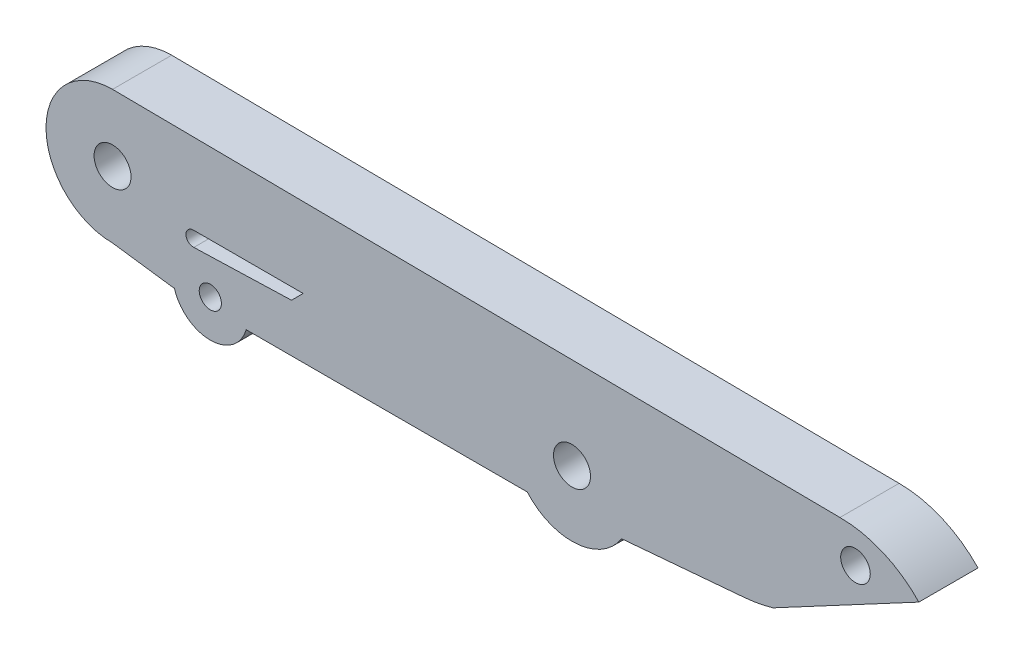
ISO-10303-21;
HEADER;
FILE_DESCRIPTION(('STEP AP214'),'2;1');
FILE_NAME('part.step','',(''),(''),'','','');
FILE_SCHEMA(('AUTOMOTIVE_DESIGN { 1 0 10303 214 1 1 1 1 }'));
ENDSEC;
DATA;
#1=APPLICATION_CONTEXT('core data for automotive mechanical design processes');
#2=APPLICATION_PROTOCOL_DEFINITION('international standard','automotive_design',2000,#1);
#3=PRODUCT_CONTEXT('',#1,'mechanical');
#4=PRODUCT('Part','Part','',(#3));
#5=PRODUCT_RELATED_PRODUCT_CATEGORY('part','',(#4));
#6=PRODUCT_DEFINITION_FORMATION('','',#4);
#7=PRODUCT_DEFINITION_CONTEXT('part definition',#1,'design');
#8=PRODUCT_DEFINITION('design','',#6,#7);
#9=PRODUCT_DEFINITION_SHAPE('','',#8);
#10=(LENGTH_UNIT() NAMED_UNIT(*) SI_UNIT(.MILLI.,.METRE.));
#11=(NAMED_UNIT(*) PLANE_ANGLE_UNIT() SI_UNIT($,.RADIAN.));
#12=(NAMED_UNIT(*) SI_UNIT($,.STERADIAN.) SOLID_ANGLE_UNIT());
#13=UNCERTAINTY_MEASURE_WITH_UNIT(LENGTH_MEASURE(1.E-05),#10,'distance_accuracy_value','');
#14=(GEOMETRIC_REPRESENTATION_CONTEXT(3) GLOBAL_UNCERTAINTY_ASSIGNED_CONTEXT((#13)) GLOBAL_UNIT_ASSIGNED_CONTEXT((#10,
#11,#12)) REPRESENTATION_CONTEXT('',''));
#15=CARTESIAN_POINT('',(0.,0.,0.));
#16=DIRECTION('',(0.,0.,1.));
#17=DIRECTION('',(1.,0.,0.));
#18=AXIS2_PLACEMENT_3D('',#15,#16,#17);
#19=CARTESIAN_POINT('',(9.71901764806382,-1.60643354689082,4.));
#20=DIRECTION('',(0.,0.,-1.));
#21=DIRECTION('',(-1.,0.,0.));
#22=AXIS2_PLACEMENT_3D('',#19,#20,#21);
#23=CYLINDRICAL_SURFACE('',#22,0.5);
#24=CARTESIAN_POINT('',(9.71901764806382,-1.60643354689082,0.));
#25=DIRECTION('',(0.,0.,1.));
#26=DIRECTION('',(1.,0.,0.));
#27=AXIS2_PLACEMENT_3D('',#24,#25,#26);
#28=CIRCLE('',#27,0.5);
#29=CARTESIAN_POINT('',(9.71901764806382,-1.10643354689082,0.));
#30=VERTEX_POINT('',#29);
#31=CARTESIAN_POINT('',(9.75050434930007,-2.10544114968386,0.));
#32=VERTEX_POINT('',#31);
#33=EDGE_CURVE('E226',#30,#32,#28,.T.);
#34=ORIENTED_EDGE('',*,*,#33,.F.);
#35=DIRECTION('',(0.,0.,-1.));
#36=VECTOR('',#35,1.);
#37=CARTESIAN_POINT('',(9.71901764806382,-1.10643354689082,4.));
#38=LINE('',#37,#36);
#39=CARTESIAN_POINT('',(9.71901764806382,-1.10643354689082,4.));
#40=VERTEX_POINT('',#39);
#41=EDGE_CURVE('E11',#40,#30,#38,.T.);
#42=ORIENTED_EDGE('',*,*,#41,.F.);
#43=CARTESIAN_POINT('',(9.71901764806382,-1.60643354689082,4.));
#44=DIRECTION('',(0.,0.,1.));
#45=DIRECTION('',(1.,0.,0.));
#46=AXIS2_PLACEMENT_3D('',#43,#44,#45);
#47=CIRCLE('',#46,0.5);
#48=CARTESIAN_POINT('',(9.75050434930007,-2.10544114968386,4.));
#49=VERTEX_POINT('',#48);
#50=EDGE_CURVE('E165',#40,#49,#47,.T.);
#51=ORIENTED_EDGE('',*,*,#50,.T.);
#52=DIRECTION('',(0.,0.,-1.));
#53=VECTOR('',#52,1.);
#54=CARTESIAN_POINT('',(9.75050434930007,-2.10544114968386,4.));
#55=LINE('',#54,#53);
#56=EDGE_CURVE('E109',#49,#32,#55,.T.);
#57=ORIENTED_EDGE('',*,*,#56,.T.);
#58=EDGE_LOOP('',(#34,#42,#51,#57));
#59=FACE_BOUND('',#58,.T.);
#60=ADVANCED_FACE('F35',(#59),#23,.F.);
#61=CARTESIAN_POINT('',(0.,-1.10643354689082,4.));
#62=DIRECTION('',(0.,1.,0.));
#63=DIRECTION('',(0.,0.,1.));
#64=AXIS2_PLACEMENT_3D('',#61,#62,#63);
#65=PLANE('',#64);
#66=DIRECTION('',(1.,0.,0.));
#67=VECTOR('',#66,1.);
#68=CARTESIAN_POINT('',(0.,-1.10643354689082,0.));
#69=LINE('',#68,#67);
#70=CARTESIAN_POINT('',(17.1467349564961,-1.10643354689082,0.));
#71=VERTEX_POINT('',#70);
#72=EDGE_CURVE('E170',#30,#71,#69,.T.);
#73=ORIENTED_EDGE('',*,*,#72,.T.);
#74=DIRECTION('',(0.,0.,-1.));
#75=VECTOR('',#74,1.);
#76=CARTESIAN_POINT('',(17.1467349564961,-1.10643354689082,4.));
#77=LINE('',#76,#75);
#78=CARTESIAN_POINT('',(17.1467349564961,-1.10643354689082,4.));
#79=VERTEX_POINT('',#78);
#80=EDGE_CURVE('E45',#79,#71,#77,.T.);
#81=ORIENTED_EDGE('',*,*,#80,.F.);
#82=DIRECTION('',(1.,0.,0.));
#83=VECTOR('',#82,1.);
#84=CARTESIAN_POINT('',(0.,-1.10643354689082,4.));
#85=LINE('',#84,#83);
#86=EDGE_CURVE('E160',#40,#79,#85,.T.);
#87=ORIENTED_EDGE('',*,*,#86,.F.);
#88=ORIENTED_EDGE('',*,*,#41,.T.);
#89=EDGE_LOOP('',(#73,#81,#87,#88));
#90=FACE_BOUND('',#89,.T.);
#91=ADVANCED_FACE('F168',(#90),#65,.F.);
#92=CARTESIAN_POINT('',(9.12658425169338,-9.12658425169347,4.));
#93=DIRECTION('',(0.707106781186544,-0.707106781186551,0.));
#94=DIRECTION('',(0.707106781186551,0.707106781186544,0.));
#95=AXIS2_PLACEMENT_3D('',#92,#93,#94);
#96=PLANE('',#95);
#97=DIRECTION('',(-0.707106781186551,-0.707106781186544,0.));
#98=VECTOR('',#97,1.);
#99=CARTESIAN_POINT('',(9.12658425169338,-9.12658425169347,0.));
#100=LINE('',#99,#98);
#101=CARTESIAN_POINT('',(16.3559166022838,-1.89725190110309,0.));
#102=VERTEX_POINT('',#101);
#103=EDGE_CURVE('E223',#71,#102,#100,.T.);
#104=ORIENTED_EDGE('',*,*,#103,.T.);
#105=DIRECTION('',(0.,0.,-1.));
#106=VECTOR('',#105,1.);
#107=CARTESIAN_POINT('',(16.3559166022838,-1.89725190110309,4.));
#108=LINE('',#107,#106);
#109=CARTESIAN_POINT('',(16.3559166022838,-1.89725190110309,4.));
#110=VERTEX_POINT('',#109);
#111=EDGE_CURVE('E159',#110,#102,#108,.T.);
#112=ORIENTED_EDGE('',*,*,#111,.F.);
#113=DIRECTION('',(-0.707106781186551,-0.707106781186544,0.));
#114=VECTOR('',#113,1.);
#115=CARTESIAN_POINT('',(9.12658425169338,-9.12658425169347,4.));
#116=LINE('',#115,#114);
#117=EDGE_CURVE('E153',#79,#110,#116,.T.);
#118=ORIENTED_EDGE('',*,*,#117,.F.);
#119=ORIENTED_EDGE('',*,*,#80,.T.);
#120=EDGE_LOOP('',(#104,#112,#118,#119));
#121=FACE_BOUND('',#120,.T.);
#122=ADVANCED_FACE('F156',(#121),#96,.F.);
#123=CARTESIAN_POINT('',(46.1270158500872,5.97056834285694,4.));
#124=DIRECTION('',(0.,0.,-1.));
#125=DIRECTION('',(-1.,0.,0.));
#126=AXIS2_PLACEMENT_3D('',#123,#124,#125);
#127=CYLINDRICAL_SURFACE('',#126,10.);
#128=CARTESIAN_POINT('',(46.1270158500872,5.97056834285694,0.));
#129=DIRECTION('',(0.,0.,1.));
#130=DIRECTION('',(1.,0.,0.));
#131=AXIS2_PLACEMENT_3D('',#128,#129,#130);
#132=CIRCLE('',#131,10.);
#133=CARTESIAN_POINT('',(48.9234589540693,-3.63046837023771,0.));
#134=VERTEX_POINT('',#133);
#135=CARTESIAN_POINT('',(46.980351468895,-3.99295604972995,0.));
#136=VERTEX_POINT('',#135);
#137=EDGE_CURVE('E250',#134,#136,#132,.F.);
#138=ORIENTED_EDGE('',*,*,#137,.F.);
#139=DIRECTION('',(0.,0.,-1.));
#140=VECTOR('',#139,1.);
#141=CARTESIAN_POINT('',(48.9234589540693,-3.63046837023771,4.));
#142=LINE('',#141,#140);
#143=CARTESIAN_POINT('',(48.9234589540693,-3.63046837023771,4.));
#144=VERTEX_POINT('',#143);
#145=EDGE_CURVE('E39',#144,#134,#142,.T.);
#146=ORIENTED_EDGE('',*,*,#145,.F.);
#147=CARTESIAN_POINT('',(46.1270158500872,5.97056834285694,4.));
#148=DIRECTION('',(0.,0.,1.));
#149=DIRECTION('',(1.,0.,0.));
#150=AXIS2_PLACEMENT_3D('',#147,#148,#149);
#151=CIRCLE('',#150,10.);
#152=CARTESIAN_POINT('',(46.980351468895,-3.99295604972995,4.));
#153=VERTEX_POINT('',#152);
#154=EDGE_CURVE('E212',#144,#153,#151,.F.);
#155=ORIENTED_EDGE('',*,*,#154,.T.);
#156=DIRECTION('',(0.,0.,-1.));
#157=VECTOR('',#156,1.);
#158=CARTESIAN_POINT('',(46.980351468895,-3.99295604972995,4.));
#159=LINE('',#158,#157);
#160=EDGE_CURVE('E175',#153,#136,#159,.T.);
#161=ORIENTED_EDGE('',*,*,#160,.T.);
#162=EDGE_LOOP('',(#138,#146,#155,#161));
#163=FACE_BOUND('',#162,.T.);
#164=ADVANCED_FACE('F37',(#163),#127,.T.);
#165=CARTESIAN_POINT('',(12.3698940911423,-23.1567149480587,4.));
#166=DIRECTION('',(-0.471170737125833,0.882042026479634,0.));
#167=DIRECTION('',(-0.882042026479634,-0.471170737125833,0.));
#168=AXIS2_PLACEMENT_3D('',#165,#166,#167);
#169=PLANE('',#168);
#170=DIRECTION('',(0.882042026479634,0.471170737125833,0.));
#171=VECTOR('',#170,1.);
#172=CARTESIAN_POINT('',(12.3698940911423,-23.1567149480587,0.));
#173=LINE('',#172,#171);
#174=CARTESIAN_POINT('',(58.7811323545646,1.63532067724634,0.));
#175=VERTEX_POINT('',#174);
#176=EDGE_CURVE('E248',#134,#175,#173,.T.);
#177=ORIENTED_EDGE('',*,*,#176,.T.);
#178=DIRECTION('',(0.,0.,-1.));
#179=VECTOR('',#178,1.);
#180=CARTESIAN_POINT('',(58.7811323545646,1.63532067724634,4.));
#181=LINE('',#180,#179);
#182=CARTESIAN_POINT('',(58.7811323545646,1.63532067724634,4.));
#183=VERTEX_POINT('',#182);
#184=EDGE_CURVE('E199',#183,#175,#181,.T.);
#185=ORIENTED_EDGE('',*,*,#184,.F.);
#186=DIRECTION('',(0.882042026479634,0.471170737125833,0.));
#187=VECTOR('',#186,1.);
#188=CARTESIAN_POINT('',(12.3698940911423,-23.1567149480587,4.));
#189=LINE('',#188,#187);
#190=EDGE_CURVE('E285',#144,#183,#189,.T.);
#191=ORIENTED_EDGE('',*,*,#190,.F.);
#192=ORIENTED_EDGE('',*,*,#145,.T.);
#193=EDGE_LOOP('',(#177,#185,#191,#192));
#194=FACE_BOUND('',#193,.T.);
#195=ADVANCED_FACE('F299',(#194),#169,.F.);
#196=CARTESIAN_POINT('',(53.445513312833,-3.43924105236474,4.));
#197=DIRECTION('',(0.,0.,-1.));
#198=DIRECTION('',(-1.,0.,0.));
#199=AXIS2_PLACEMENT_3D('',#196,#197,#198);
#200=CYLINDRICAL_SURFACE('',#199,7.36342361311113);
#201=CARTESIAN_POINT('',(53.445513312833,-3.43924105236474,0.));
#202=DIRECTION('',(0.,0.,1.));
#203=DIRECTION('',(1.,0.,0.));
#204=AXIS2_PLACEMENT_3D('',#201,#202,#203);
#205=CIRCLE('',#204,7.36342361311113);
#206=CARTESIAN_POINT('',(53.445513312833,3.92418256074639,0.));
#207=VERTEX_POINT('',#206);
#208=EDGE_CURVE('E246',#175,#207,#205,.T.);
#209=ORIENTED_EDGE('',*,*,#208,.T.);
#210=DIRECTION('',(0.,0.,-1.));
#211=VECTOR('',#210,1.);
#212=CARTESIAN_POINT('',(53.445513312833,3.92418256074639,4.));
#213=LINE('',#212,#211);
#214=CARTESIAN_POINT('',(53.445513312833,3.92418256074639,4.));
#215=VERTEX_POINT('',#214);
#216=EDGE_CURVE('E198',#215,#207,#213,.T.);
#217=ORIENTED_EDGE('',*,*,#216,.F.);
#218=CARTESIAN_POINT('',(53.445513312833,-3.43924105236474,4.));
#219=DIRECTION('',(0.,0.,1.));
#220=DIRECTION('',(1.,0.,0.));
#221=AXIS2_PLACEMENT_3D('',#218,#219,#220);
#222=CIRCLE('',#221,7.36342361311113);
#223=EDGE_CURVE('E283',#183,#215,#222,.T.);
#224=ORIENTED_EDGE('',*,*,#223,.F.);
#225=ORIENTED_EDGE('',*,*,#184,.T.);
#226=EDGE_LOOP('',(#209,#217,#224,#225));
#227=FACE_BOUND('',#226,.T.);
#228=ADVANCED_FACE('F301',(#227),#200,.T.);
#229=CARTESIAN_POINT('',(0.0432166339505001,4.44355651289284,4.));
#230=DIRECTION('',(0.00972522574244948,0.999952708873904,0.));
#231=DIRECTION('',(-0.999952708873904,0.00972522574244948,0.));
#232=AXIS2_PLACEMENT_3D('',#229,#230,#231);
#233=PLANE('',#232);
#234=DIRECTION('',(0.999952708873904,-0.00972522574244948,0.));
#235=VECTOR('',#234,1.);
#236=CARTESIAN_POINT('',(0.0432166339505001,4.44355651289284,0.));
#237=LINE('',#236,#235);
#238=CARTESIAN_POINT('',(4.25422013759811,4.40260161641445,0.));
#239=VERTEX_POINT('',#238);
#240=EDGE_CURVE('E243',#239,#207,#237,.T.);
#241=ORIENTED_EDGE('',*,*,#240,.F.);
#242=DIRECTION('',(0.,0.,-1.));
#243=VECTOR('',#242,1.);
#244=CARTESIAN_POINT('',(4.25422013759811,4.40260161641445,4.));
#245=LINE('',#244,#243);
#246=CARTESIAN_POINT('',(4.25422013759811,4.40260161641445,4.));
#247=VERTEX_POINT('',#246);
#248=EDGE_CURVE('E196',#247,#239,#245,.T.);
#249=ORIENTED_EDGE('',*,*,#248,.F.);
#250=DIRECTION('',(0.999952708873904,-0.00972522574244948,0.));
#251=VECTOR('',#250,1.);
#252=CARTESIAN_POINT('',(0.0432166339505001,4.44355651289284,4.));
#253=LINE('',#252,#251);
#254=EDGE_CURVE('E280',#247,#215,#253,.T.);
#255=ORIENTED_EDGE('',*,*,#254,.T.);
#256=ORIENTED_EDGE('',*,*,#216,.T.);
#257=EDGE_LOOP('',(#241,#249,#255,#256));
#258=FACE_BOUND('',#257,.T.);
#259=ADVANCED_FACE('F307',(#258),#233,.T.);
#260=CARTESIAN_POINT('',(4.25422013759811,-0.0973983835855499,4.));
#261=DIRECTION('',(0.,0.,-1.));
#262=DIRECTION('',(-1.,0.,0.));
#263=AXIS2_PLACEMENT_3D('',#260,#261,#262);
#264=CYLINDRICAL_SURFACE('',#263,4.5);
#265=CARTESIAN_POINT('',(4.25422013759811,-0.0973983835855499,0.));
#266=DIRECTION('',(0.,0.,1.));
#267=DIRECTION('',(1.,0.,0.));
#268=AXIS2_PLACEMENT_3D('',#265,#266,#267);
#269=CIRCLE('',#268,4.5);
#270=CARTESIAN_POINT('',(4.25422013759811,-4.59739838358555,0.));
#271=VERTEX_POINT('',#270);
#272=EDGE_CURVE('E241',#239,#271,#269,.T.);
#273=ORIENTED_EDGE('',*,*,#272,.T.);
#274=DIRECTION('',(0.,0.,-1.));
#275=VECTOR('',#274,1.);
#276=CARTESIAN_POINT('',(4.25422013759811,-4.59739838358555,4.));
#277=LINE('',#276,#275);
#278=CARTESIAN_POINT('',(4.25422013759811,-4.59739838358555,4.));
#279=VERTEX_POINT('',#278);
#280=EDGE_CURVE('E193',#279,#271,#277,.T.);
#281=ORIENTED_EDGE('',*,*,#280,.F.);
#282=CARTESIAN_POINT('',(4.25422013759811,-0.0973983835855499,4.));
#283=DIRECTION('',(0.,0.,1.));
#284=DIRECTION('',(1.,0.,0.));
#285=AXIS2_PLACEMENT_3D('',#282,#283,#284);
#286=CIRCLE('',#285,4.5);
#287=EDGE_CURVE('E278',#247,#279,#286,.T.);
#288=ORIENTED_EDGE('',*,*,#287,.F.);
#289=ORIENTED_EDGE('',*,*,#248,.T.);
#290=EDGE_LOOP('',(#273,#281,#288,#289));
#291=FACE_BOUND('',#290,.T.);
#292=ADVANCED_FACE('F310',(#291),#264,.T.);
#293=CARTESIAN_POINT('',(-0.537610407586847,-3.94426292555236,4.));
#294=DIRECTION('',(0.135053120034921,0.990838359556609,0.));
#295=DIRECTION('',(-0.99083835955661,0.135053120034921,0.));
#296=AXIS2_PLACEMENT_3D('',#293,#294,#295);
#297=PLANE('',#296);
#298=DIRECTION('',(0.99083835955661,-0.135053120034921,0.));
#299=VECTOR('',#298,1.);
#300=CARTESIAN_POINT('',(-0.537610407586847,-3.94426292555236,0.));
#301=LINE('',#300,#299);
#302=CARTESIAN_POINT('',(8.34694668437866,-5.15524466018692,0.));
#303=VERTEX_POINT('',#302);
#304=EDGE_CURVE('E239',#271,#303,#301,.T.);
#305=ORIENTED_EDGE('',*,*,#304,.T.);
#306=DIRECTION('',(0.,0.,-1.));
#307=VECTOR('',#306,1.);
#308=CARTESIAN_POINT('',(8.34694668437866,-5.15524466018692,4.));
#309=LINE('',#308,#307);
#310=CARTESIAN_POINT('',(8.34694668437866,-5.15524466018692,4.));
#311=VERTEX_POINT('',#310);
#312=EDGE_CURVE('E190',#311,#303,#309,.T.);
#313=ORIENTED_EDGE('',*,*,#312,.F.);
#314=DIRECTION('',(0.99083835955661,-0.135053120034921,0.));
#315=VECTOR('',#314,1.);
#316=CARTESIAN_POINT('',(-0.537610407586847,-3.94426292555236,4.));
#317=LINE('',#316,#315);
#318=EDGE_CURVE('E276',#279,#311,#317,.T.);
#319=ORIENTED_EDGE('',*,*,#318,.F.);
#320=ORIENTED_EDGE('',*,*,#280,.T.);
#321=EDGE_LOOP('',(#305,#313,#319,#320));
#322=FACE_BOUND('',#321,.T.);
#323=ADVANCED_FACE('F315',(#322),#297,.F.);
#324=CARTESIAN_POINT('',(0.,-5.15524466018692,4.));
#325=DIRECTION('',(0.,1.,0.));
#326=DIRECTION('',(0.,0.,1.));
#327=AXIS2_PLACEMENT_3D('',#324,#325,#326);
#328=PLANE('',#327);
#329=DIRECTION('',(1.,0.,0.));
#330=VECTOR('',#329,1.);
#331=CARTESIAN_POINT('',(0.,-5.15524466018692,0.));
#332=LINE('',#331,#330);
#333=CARTESIAN_POINT('',(8.43983883590455,-5.15524466018692,0.));
#334=VERTEX_POINT('',#333);
#335=EDGE_CURVE('E237',#303,#334,#332,.T.);
#336=ORIENTED_EDGE('',*,*,#335,.T.);
#337=DIRECTION('',(0.,0.,-1.));
#338=VECTOR('',#337,1.);
#339=CARTESIAN_POINT('',(8.43983883590455,-5.15524466018692,4.));
#340=LINE('',#339,#338);
#341=CARTESIAN_POINT('',(8.43983883590455,-5.15524466018692,4.));
#342=VERTEX_POINT('',#341);
#343=EDGE_CURVE('E187',#342,#334,#340,.T.);
#344=ORIENTED_EDGE('',*,*,#343,.F.);
#345=DIRECTION('',(1.,0.,0.));
#346=VECTOR('',#345,1.);
#347=CARTESIAN_POINT('',(0.,-5.15524466018692,4.));
#348=LINE('',#347,#346);
#349=EDGE_CURVE('E274',#311,#342,#348,.T.);
#350=ORIENTED_EDGE('',*,*,#349,.F.);
#351=ORIENTED_EDGE('',*,*,#312,.T.);
#352=EDGE_LOOP('',(#336,#344,#350,#351));
#353=FACE_BOUND('',#352,.T.);
#354=ADVANCED_FACE('F321',(#353),#328,.F.);
#355=CARTESIAN_POINT('',(10.8660402938717,-4.45583670673065,4.));
#356=DIRECTION('',(0.,0.,-1.));
#357=DIRECTION('',(-1.,0.,0.));
#358=AXIS2_PLACEMENT_3D('',#355,#356,#357);
#359=CYLINDRICAL_SURFACE('',#358,2.525);
#360=CARTESIAN_POINT('',(10.8660402938717,-4.45583670673065,0.));
#361=DIRECTION('',(0.,0.,1.));
#362=DIRECTION('',(1.,0.,0.));
#363=AXIS2_PLACEMENT_3D('',#360,#361,#362);
#364=CIRCLE('',#363,2.525);
#365=CARTESIAN_POINT('',(13.2922417518389,-5.15524466018692,0.));
#366=VERTEX_POINT('',#365);
#367=EDGE_CURVE('E235',#334,#366,#364,.T.);
#368=ORIENTED_EDGE('',*,*,#367,.T.);
#369=DIRECTION('',(0.,0.,-1.));
#370=VECTOR('',#369,1.);
#371=CARTESIAN_POINT('',(13.2922417518389,-5.15524466018692,4.));
#372=LINE('',#371,#370);
#373=CARTESIAN_POINT('',(13.2922417518389,-5.15524466018692,4.));
#374=VERTEX_POINT('',#373);
#375=EDGE_CURVE('E184',#374,#366,#372,.T.);
#376=ORIENTED_EDGE('',*,*,#375,.F.);
#377=CARTESIAN_POINT('',(10.8660402938717,-4.45583670673065,4.));
#378=DIRECTION('',(0.,0.,1.));
#379=DIRECTION('',(1.,0.,0.));
#380=AXIS2_PLACEMENT_3D('',#377,#378,#379);
#381=CIRCLE('',#380,2.525);
#382=EDGE_CURVE('E272',#342,#374,#381,.T.);
#383=ORIENTED_EDGE('',*,*,#382,.F.);
#384=ORIENTED_EDGE('',*,*,#343,.T.);
#385=EDGE_LOOP('',(#368,#376,#383,#384));
#386=FACE_BOUND('',#385,.T.);
#387=ADVANCED_FACE('F325',(#386),#359,.T.);
#388=CARTESIAN_POINT('',(0.,-5.15524466018692,4.));
#389=DIRECTION('',(0.,1.,0.));
#390=DIRECTION('',(0.,0.,1.));
#391=AXIS2_PLACEMENT_3D('',#388,#389,#390);
#392=PLANE('',#391);
#393=DIRECTION('',(1.,0.,0.));
#394=VECTOR('',#393,1.);
#395=CARTESIAN_POINT('',(0.,-5.15524466018692,0.));
#396=LINE('',#395,#394);
#397=CARTESIAN_POINT('',(32.3042481637169,-5.15524466018692,0.));
#398=VERTEX_POINT('',#397);
#399=EDGE_CURVE('E233',#366,#398,#396,.T.);
#400=ORIENTED_EDGE('',*,*,#399,.T.);
#401=DIRECTION('',(0.,0.,-1.));
#402=VECTOR('',#401,1.);
#403=CARTESIAN_POINT('',(32.3042481637169,-5.15524466018692,4.));
#404=LINE('',#403,#402);
#405=CARTESIAN_POINT('',(32.3042481637169,-5.15524466018692,4.));
#406=VERTEX_POINT('',#405);
#407=EDGE_CURVE('E181',#406,#398,#404,.T.);
#408=ORIENTED_EDGE('',*,*,#407,.F.);
#409=DIRECTION('',(1.,0.,0.));
#410=VECTOR('',#409,1.);
#411=CARTESIAN_POINT('',(0.,-5.15524466018692,4.));
#412=LINE('',#411,#410);
#413=EDGE_CURVE('E270',#374,#406,#412,.T.);
#414=ORIENTED_EDGE('',*,*,#413,.F.);
#415=ORIENTED_EDGE('',*,*,#375,.T.);
#416=EDGE_LOOP('',(#400,#408,#414,#415));
#417=FACE_BOUND('',#416,.T.);
#418=ADVANCED_FACE('F330',(#417),#392,.F.);
#419=CARTESIAN_POINT('',(35.325099909026,-2.53332652018663,4.));
#420=DIRECTION('',(0.,0.,-1.));
#421=DIRECTION('',(-1.,0.,0.));
#422=AXIS2_PLACEMENT_3D('',#419,#420,#421);
#423=CYLINDRICAL_SURFACE('',#422,4.);
#424=CARTESIAN_POINT('',(35.325099909026,-2.53332652018663,0.));
#425=DIRECTION('',(0.,0.,1.));
#426=DIRECTION('',(1.,0.,0.));
#427=AXIS2_PLACEMENT_3D('',#424,#425,#426);
#428=CIRCLE('',#427,4.);
#429=CARTESIAN_POINT('',(38.6852785427031,-4.70339553977572,0.));
#430=VERTEX_POINT('',#429);
#431=EDGE_CURVE('E231',#398,#430,#428,.T.);
#432=ORIENTED_EDGE('',*,*,#431,.T.);
#433=DIRECTION('',(0.,0.,-1.));
#434=VECTOR('',#433,1.);
#435=CARTESIAN_POINT('',(38.6852785427031,-4.70339553977572,4.));
#436=LINE('',#435,#434);
#437=CARTESIAN_POINT('',(38.6852785427031,-4.70339553977572,4.));
#438=VERTEX_POINT('',#437);
#439=EDGE_CURVE('E177',#438,#430,#436,.T.);
#440=ORIENTED_EDGE('',*,*,#439,.F.);
#441=CARTESIAN_POINT('',(35.325099909026,-2.53332652018663,4.));
#442=DIRECTION('',(0.,0.,1.));
#443=DIRECTION('',(1.,0.,0.));
#444=AXIS2_PLACEMENT_3D('',#441,#442,#443);
#445=CIRCLE('',#444,4.);
#446=EDGE_CURVE('E268',#406,#438,#445,.T.);
#447=ORIENTED_EDGE('',*,*,#446,.F.);
#448=ORIENTED_EDGE('',*,*,#407,.T.);
#449=EDGE_LOOP('',(#432,#440,#447,#448));
#450=FACE_BOUND('',#449,.T.);
#451=ADVANCED_FACE('F332',(#450),#423,.T.);
#452=CARTESIAN_POINT('',(4.25422013759811,-0.0973983835855499,4.));
#453=DIRECTION('',(0.,0.,-1.));
#454=DIRECTION('',(-1.,0.,0.));
#455=AXIS2_PLACEMENT_3D('',#452,#453,#454);
#456=CYLINDRICAL_SURFACE('',#455,1.25);
#457=CARTESIAN_POINT('',(4.25422013759811,-0.0973983835855499,4.));
#458=DIRECTION('',(0.,0.,1.));
#459=DIRECTION('',(1.,0.,0.));
#460=AXIS2_PLACEMENT_3D('',#457,#458,#459);
#461=CIRCLE('',#460,1.25);
#462=CARTESIAN_POINT('',(5.50422013759811,-0.0973983835855499,4.));
#463=VERTEX_POINT('',#462);
#464=EDGE_CURVE('E255',#463,#463,#461,.T.);
#465=ORIENTED_EDGE('',*,*,#464,.T.);
#466=EDGE_LOOP('',(#465));
#467=FACE_BOUND('',#466,.T.);
#468=CARTESIAN_POINT('',(4.25422013759811,-0.0973983835855499,0.));
#469=DIRECTION('',(0.,0.,1.));
#470=DIRECTION('',(1.,0.,0.));
#471=AXIS2_PLACEMENT_3D('',#468,#469,#470);
#472=CIRCLE('',#471,1.25);
#473=CARTESIAN_POINT('',(5.50422013759811,-0.0973983835855499,0.));
#474=VERTEX_POINT('',#473);
#475=EDGE_CURVE('E213',#474,#474,#472,.T.);
#476=ORIENTED_EDGE('',*,*,#475,.F.);
#477=EDGE_LOOP('',(#476));
#478=FACE_BOUND('',#477,.T.);
#479=ADVANCED_FACE('F334',(#467,#478),#456,.F.);
#480=CARTESIAN_POINT('',(35.325099909026,-2.10544114968386,4.));
#481=DIRECTION('',(0.,0.,-1.));
#482=DIRECTION('',(-1.,0.,0.));
#483=AXIS2_PLACEMENT_3D('',#480,#481,#482);
#484=CYLINDRICAL_SURFACE('',#483,1.25);
#485=CARTESIAN_POINT('',(35.325099909026,-2.10544114968386,4.));
#486=DIRECTION('',(0.,0.,1.));
#487=DIRECTION('',(1.,0.,0.));
#488=AXIS2_PLACEMENT_3D('',#485,#486,#487);
#489=CIRCLE('',#488,1.25);
#490=CARTESIAN_POINT('',(36.575099909026,-2.10544114968386,4.));
#491=VERTEX_POINT('',#490);
#492=EDGE_CURVE('E258',#491,#491,#489,.T.);
#493=ORIENTED_EDGE('',*,*,#492,.T.);
#494=EDGE_LOOP('',(#493));
#495=FACE_BOUND('',#494,.T.);
#496=CARTESIAN_POINT('',(35.325099909026,-2.10544114968386,0.));
#497=DIRECTION('',(0.,0.,1.));
#498=DIRECTION('',(1.,0.,0.));
#499=AXIS2_PLACEMENT_3D('',#496,#497,#498);
#500=CIRCLE('',#499,1.25);
#501=CARTESIAN_POINT('',(36.575099909026,-2.10544114968386,0.));
#502=VERTEX_POINT('',#501);
#503=EDGE_CURVE('E216',#502,#502,#500,.T.);
#504=ORIENTED_EDGE('',*,*,#503,.F.);
#505=EDGE_LOOP('',(#504));
#506=FACE_BOUND('',#505,.T.);
#507=ADVANCED_FACE('F340',(#495,#506),#484,.F.);
#508=CARTESIAN_POINT('',(54.495894223683,1.63532067724634,4.));
#509=DIRECTION('',(0.,0.,-1.));
#510=DIRECTION('',(-1.,0.,0.));
#511=AXIS2_PLACEMENT_3D('',#508,#509,#510);
#512=CYLINDRICAL_SURFACE('',#511,0.999999999999998);
#513=CARTESIAN_POINT('',(54.495894223683,1.63532067724634,4.));
#514=DIRECTION('',(0.,0.,1.));
#515=DIRECTION('',(1.,0.,0.));
#516=AXIS2_PLACEMENT_3D('',#513,#514,#515);
#517=CIRCLE('',#516,0.999999999999998);
#518=CARTESIAN_POINT('',(55.495894223683,1.63532067724634,4.));
#519=VERTEX_POINT('',#518);
#520=EDGE_CURVE('E261',#519,#519,#517,.T.);
#521=ORIENTED_EDGE('',*,*,#520,.T.);
#522=EDGE_LOOP('',(#521));
#523=FACE_BOUND('',#522,.T.);
#524=CARTESIAN_POINT('',(54.495894223683,1.63532067724634,0.));
#525=DIRECTION('',(0.,0.,1.));
#526=DIRECTION('',(1.,0.,0.));
#527=AXIS2_PLACEMENT_3D('',#524,#525,#526);
#528=CIRCLE('',#527,0.999999999999998);
#529=CARTESIAN_POINT('',(55.495894223683,1.63532067724634,0.));
#530=VERTEX_POINT('',#529);
#531=EDGE_CURVE('E219',#530,#530,#528,.T.);
#532=ORIENTED_EDGE('',*,*,#531,.F.);
#533=EDGE_LOOP('',(#532));
#534=FACE_BOUND('',#533,.T.);
#535=ADVANCED_FACE('F361',(#523,#534),#512,.F.);
#536=CARTESIAN_POINT('',(0.0759697697332692,-2.41036293311666,4.));
#537=DIRECTION('',(0.031502336531711,-0.999503678228871,0.));
#538=DIRECTION('',(0.999503678228871,0.031502336531711,0.));
#539=AXIS2_PLACEMENT_3D('',#536,#537,#538);
#540=PLANE('',#539);
#541=DIRECTION('',(-0.999503678228871,-0.031502336531711,0.));
#542=VECTOR('',#541,1.);
#543=CARTESIAN_POINT('',(0.0759697697332692,-2.41036293311666,0.));
#544=LINE('',#543,#542);
#545=EDGE_CURVE('E102',#102,#32,#544,.T.);
#546=ORIENTED_EDGE('',*,*,#545,.T.);
#547=ORIENTED_EDGE('',*,*,#56,.F.);
#548=DIRECTION('',(-0.999503678228871,-0.031502336531711,0.));
#549=VECTOR('',#548,1.);
#550=CARTESIAN_POINT('',(0.0759697697332692,-2.41036293311666,4.));
#551=LINE('',#550,#549);
#552=EDGE_CURVE('E54',#110,#49,#551,.T.);
#553=ORIENTED_EDGE('',*,*,#552,.F.);
#554=ORIENTED_EDGE('',*,*,#111,.T.);
#555=EDGE_LOOP('',(#546,#547,#553,#554));
#556=FACE_BOUND('',#555,.T.);
#557=ADVANCED_FACE('F354',(#556),#540,.F.);
#558=CARTESIAN_POINT('',(0.68159262906103,-7.9582577309321,4.));
#559=DIRECTION('',(-0.0853335618807812,0.996352439258689,0.));
#560=DIRECTION('',(-0.996352439258689,-0.0853335618807812,0.));
#561=AXIS2_PLACEMENT_3D('',#558,#559,#560);
#562=PLANE('',#561);
#563=DIRECTION('',(0.996352439258689,0.0853335618807812,0.));
#564=VECTOR('',#563,1.);
#565=CARTESIAN_POINT('',(0.68159262906103,-7.9582577309321,0.));
#566=LINE('',#565,#564);
#567=EDGE_CURVE('E228',#430,#136,#566,.T.);
#568=ORIENTED_EDGE('',*,*,#567,.T.);
#569=ORIENTED_EDGE('',*,*,#160,.F.);
#570=DIRECTION('',(0.996352439258689,0.0853335618807812,0.));
#571=VECTOR('',#570,1.);
#572=CARTESIAN_POINT('',(0.68159262906103,-7.9582577309321,4.));
#573=LINE('',#572,#571);
#574=EDGE_CURVE('E266',#438,#153,#573,.T.);
#575=ORIENTED_EDGE('',*,*,#574,.F.);
#576=ORIENTED_EDGE('',*,*,#439,.T.);
#577=EDGE_LOOP('',(#568,#569,#575,#576));
#578=FACE_BOUND('',#577,.T.);
#579=ADVANCED_FACE('F294',(#578),#562,.F.);
#580=CARTESIAN_POINT('',(10.8660402938717,-4.45583670673065,4.));
#581=DIRECTION('',(0.,0.,-1.));
#582=DIRECTION('',(-1.,0.,0.));
#583=AXIS2_PLACEMENT_3D('',#580,#581,#582);
#584=CYLINDRICAL_SURFACE('',#583,0.75);
#585=CARTESIAN_POINT('',(10.8660402938717,-4.45583670673065,4.));
#586=DIRECTION('',(0.,0.,1.));
#587=DIRECTION('',(1.,0.,0.));
#588=AXIS2_PLACEMENT_3D('',#585,#586,#587);
#589=CIRCLE('',#588,0.75);
#590=CARTESIAN_POINT('',(11.6160402938717,-4.45583670673065,4.));
#591=VERTEX_POINT('',#590);
#592=EDGE_CURVE('E178',#591,#591,#589,.T.);
#593=ORIENTED_EDGE('',*,*,#592,.T.);
#594=EDGE_LOOP('',(#593));
#595=FACE_BOUND('',#594,.T.);
#596=CARTESIAN_POINT('',(10.8660402938717,-4.45583670673065,0.));
#597=DIRECTION('',(0.,0.,1.));
#598=DIRECTION('',(1.,0.,0.));
#599=AXIS2_PLACEMENT_3D('',#596,#597,#598);
#600=CIRCLE('',#599,0.75);
#601=CARTESIAN_POINT('',(11.6160402938717,-4.45583670673065,0.));
#602=VERTEX_POINT('',#601);
#603=EDGE_CURVE('E209',#602,#602,#600,.T.);
#604=ORIENTED_EDGE('',*,*,#603,.F.);
#605=EDGE_LOOP('',(#604));
#606=FACE_BOUND('',#605,.T.);
#607=ADVANCED_FACE('F353',(#595,#606),#584,.F.);
#608=CARTESIAN_POINT('',(0.,0.,4.));
#609=DIRECTION('',(0.,0.,1.));
#610=DIRECTION('',(1.,0.,0.));
#611=AXIS2_PLACEMENT_3D('',#608,#609,#610);
#612=PLANE('',#611);
#613=ORIENTED_EDGE('',*,*,#154,.F.);
#614=ORIENTED_EDGE('',*,*,#190,.T.);
#615=ORIENTED_EDGE('',*,*,#223,.T.);
#616=ORIENTED_EDGE('',*,*,#254,.F.);
#617=ORIENTED_EDGE('',*,*,#287,.T.);
#618=ORIENTED_EDGE('',*,*,#318,.T.);
#619=ORIENTED_EDGE('',*,*,#349,.T.);
#620=ORIENTED_EDGE('',*,*,#382,.T.);
#621=ORIENTED_EDGE('',*,*,#413,.T.);
#622=ORIENTED_EDGE('',*,*,#446,.T.);
#623=ORIENTED_EDGE('',*,*,#574,.T.);
#624=EDGE_LOOP('',(#613,#614,#615,#616,#617,#618,#619,#620,#621,#622,#623));
#625=FACE_BOUND('',#624,.T.);
#626=ORIENTED_EDGE('',*,*,#50,.F.);
#627=ORIENTED_EDGE('',*,*,#86,.T.);
#628=ORIENTED_EDGE('',*,*,#117,.T.);
#629=ORIENTED_EDGE('',*,*,#552,.T.);
#630=EDGE_LOOP('',(#626,#627,#628,#629));
#631=FACE_BOUND('',#630,.T.);
#632=ORIENTED_EDGE('',*,*,#520,.F.);
#633=EDGE_LOOP('',(#632));
#634=FACE_BOUND('',#633,.T.);
#635=ORIENTED_EDGE('',*,*,#492,.F.);
#636=EDGE_LOOP('',(#635));
#637=FACE_BOUND('',#636,.T.);
#638=ORIENTED_EDGE('',*,*,#464,.F.);
#639=EDGE_LOOP('',(#638));
#640=FACE_BOUND('',#639,.T.);
#641=ORIENTED_EDGE('',*,*,#592,.F.);
#642=EDGE_LOOP('',(#641));
#643=FACE_BOUND('',#642,.T.);
#644=ADVANCED_FACE('F163',(#625,#631,#634,#637,#640,#643),#612,.T.);
#645=CARTESIAN_POINT('',(0.,0.,0.));
#646=DIRECTION('',(0.,0.,1.));
#647=DIRECTION('',(1.,0.,0.));
#648=AXIS2_PLACEMENT_3D('',#645,#646,#647);
#649=PLANE('',#648);
#650=ORIENTED_EDGE('',*,*,#137,.T.);
#651=ORIENTED_EDGE('',*,*,#567,.F.);
#652=ORIENTED_EDGE('',*,*,#431,.F.);
#653=ORIENTED_EDGE('',*,*,#399,.F.);
#654=ORIENTED_EDGE('',*,*,#367,.F.);
#655=ORIENTED_EDGE('',*,*,#335,.F.);
#656=ORIENTED_EDGE('',*,*,#304,.F.);
#657=ORIENTED_EDGE('',*,*,#272,.F.);
#658=ORIENTED_EDGE('',*,*,#240,.T.);
#659=ORIENTED_EDGE('',*,*,#208,.F.);
#660=ORIENTED_EDGE('',*,*,#176,.F.);
#661=EDGE_LOOP('',(#650,#651,#652,#653,#654,#655,#656,#657,#658,#659,#660));
#662=FACE_BOUND('',#661,.T.);
#663=ORIENTED_EDGE('',*,*,#33,.T.);
#664=ORIENTED_EDGE('',*,*,#545,.F.);
#665=ORIENTED_EDGE('',*,*,#103,.F.);
#666=ORIENTED_EDGE('',*,*,#72,.F.);
#667=EDGE_LOOP('',(#663,#664,#665,#666));
#668=FACE_BOUND('',#667,.T.);
#669=ORIENTED_EDGE('',*,*,#531,.T.);
#670=EDGE_LOOP('',(#669));
#671=FACE_BOUND('',#670,.T.);
#672=ORIENTED_EDGE('',*,*,#503,.T.);
#673=EDGE_LOOP('',(#672));
#674=FACE_BOUND('',#673,.T.);
#675=ORIENTED_EDGE('',*,*,#475,.T.);
#676=EDGE_LOOP('',(#675));
#677=FACE_BOUND('',#676,.T.);
#678=ORIENTED_EDGE('',*,*,#603,.T.);
#679=EDGE_LOOP('',(#678));
#680=FACE_BOUND('',#679,.T.);
#681=ADVANCED_FACE('F298',(#662,#668,#671,#674,#677,#680),#649,.F.);
#682=CLOSED_SHELL('',(#60,#91,#122,#164,#195,#228,#259,#292,#323,#354,#387,#418,#451,#479,#507,
#535,#557,#579,#607,#644,#681));
#683=MANIFOLD_SOLID_BREP('B2',#682);
#684=ADVANCED_BREP_SHAPE_REPRESENTATION('',(#18,#683),#14);
#685=SHAPE_DEFINITION_REPRESENTATION(#9,#684);
ENDSEC;
END-ISO-10303-21;
